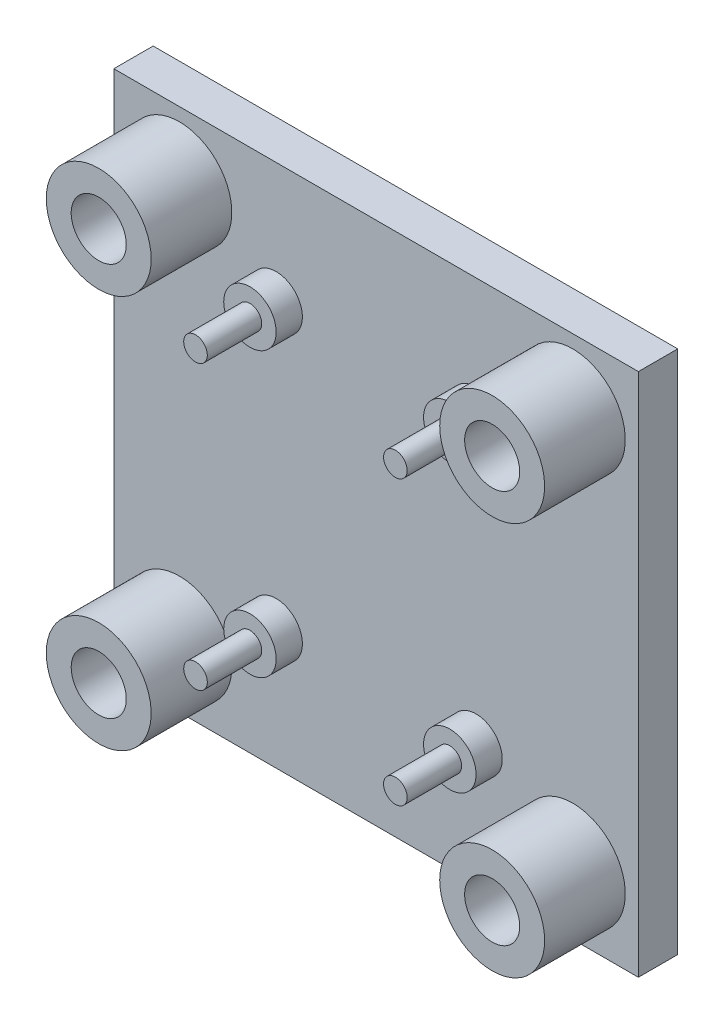
ISO-10303-21;
HEADER;
FILE_DESCRIPTION(('STEP AP214'),'2;1');
FILE_NAME('part.step','',(''),(''),'','','');
FILE_SCHEMA(('AUTOMOTIVE_DESIGN { 1 0 10303 214 1 1 1 1 }'));
ENDSEC;
DATA;
#1=APPLICATION_CONTEXT('core data for automotive mechanical design processes');
#2=APPLICATION_PROTOCOL_DEFINITION('international standard','automotive_design',2000,#1);
#3=PRODUCT_CONTEXT('',#1,'mechanical');
#4=PRODUCT('Part','Part','',(#3));
#5=PRODUCT_RELATED_PRODUCT_CATEGORY('part','',(#4));
#6=PRODUCT_DEFINITION_FORMATION('','',#4);
#7=PRODUCT_DEFINITION_CONTEXT('part definition',#1,'design');
#8=PRODUCT_DEFINITION('design','',#6,#7);
#9=PRODUCT_DEFINITION_SHAPE('','',#8);
#10=(LENGTH_UNIT() NAMED_UNIT(*) SI_UNIT(.MILLI.,.METRE.));
#11=(NAMED_UNIT(*) PLANE_ANGLE_UNIT() SI_UNIT($,.RADIAN.));
#12=(NAMED_UNIT(*) SI_UNIT($,.STERADIAN.) SOLID_ANGLE_UNIT());
#13=UNCERTAINTY_MEASURE_WITH_UNIT(LENGTH_MEASURE(1.E-05),#10,'distance_accuracy_value','');
#14=(GEOMETRIC_REPRESENTATION_CONTEXT(3) GLOBAL_UNCERTAINTY_ASSIGNED_CONTEXT((#13)) GLOBAL_UNIT_ASSIGNED_CONTEXT((#10,
#11,#12)) REPRESENTATION_CONTEXT('',''));
#15=CARTESIAN_POINT('',(0.,0.,0.));
#16=DIRECTION('',(0.,0.,1.));
#17=DIRECTION('',(1.,0.,0.));
#18=AXIS2_PLACEMENT_3D('',#15,#16,#17);
#19=CARTESIAN_POINT('',(20.,-20.,3.));
#20=DIRECTION('',(-1.,0.,0.));
#21=DIRECTION('',(0.,0.,1.));
#22=AXIS2_PLACEMENT_3D('',#19,#20,#21);
#23=PLANE('',#22);
#24=DIRECTION('',(0.,1.,0.));
#25=VECTOR('',#24,1.);
#26=CARTESIAN_POINT('',(20.,-20.,0.));
#27=LINE('',#26,#25);
#28=CARTESIAN_POINT('',(20.,-20.,0.));
#29=VERTEX_POINT('',#28);
#30=CARTESIAN_POINT('',(20.,20.,0.));
#31=VERTEX_POINT('',#30);
#32=EDGE_CURVE('E104',#29,#31,#27,.T.);
#33=ORIENTED_EDGE('',*,*,#32,.T.);
#34=DIRECTION('',(0.,0.,-1.));
#35=VECTOR('',#34,1.);
#36=CARTESIAN_POINT('',(20.,20.,3.));
#37=LINE('',#36,#35);
#38=CARTESIAN_POINT('',(20.,20.,3.));
#39=VERTEX_POINT('',#38);
#40=EDGE_CURVE('E95',#39,#31,#37,.T.);
#41=ORIENTED_EDGE('',*,*,#40,.F.);
#42=DIRECTION('',(0.,1.,0.));
#43=VECTOR('',#42,1.);
#44=CARTESIAN_POINT('',(20.,-20.,3.));
#45=LINE('',#44,#43);
#46=CARTESIAN_POINT('',(20.,-20.,3.));
#47=VERTEX_POINT('',#46);
#48=EDGE_CURVE('E89',#47,#39,#45,.T.);
#49=ORIENTED_EDGE('',*,*,#48,.F.);
#50=DIRECTION('',(0.,0.,-1.));
#51=VECTOR('',#50,1.);
#52=CARTESIAN_POINT('',(20.,-20.,3.));
#53=LINE('',#52,#51);
#54=EDGE_CURVE('E100',#47,#29,#53,.T.);
#55=ORIENTED_EDGE('',*,*,#54,.T.);
#56=EDGE_LOOP('',(#33,#41,#49,#55));
#57=FACE_BOUND('',#56,.T.);
#58=ADVANCED_FACE('F37',(#57),#23,.F.);
#59=CARTESIAN_POINT('',(-20.,20.,3.));
#60=DIRECTION('',(0.,-1.,0.));
#61=DIRECTION('',(0.,0.,-1.));
#62=AXIS2_PLACEMENT_3D('',#59,#60,#61);
#63=PLANE('',#62);
#64=DIRECTION('',(-1.,0.,0.));
#65=VECTOR('',#64,1.);
#66=CARTESIAN_POINT('',(-20.,20.,0.));
#67=LINE('',#66,#65);
#68=CARTESIAN_POINT('',(-20.,20.,0.));
#69=VERTEX_POINT('',#68);
#70=EDGE_CURVE('E94',#31,#69,#67,.T.);
#71=ORIENTED_EDGE('',*,*,#70,.T.);
#72=DIRECTION('',(0.,0.,-1.));
#73=VECTOR('',#72,1.);
#74=CARTESIAN_POINT('',(-20.,20.,3.));
#75=LINE('',#74,#73);
#76=CARTESIAN_POINT('',(-20.,20.,3.));
#77=VERTEX_POINT('',#76);
#78=EDGE_CURVE('E92',#77,#69,#75,.T.);
#79=ORIENTED_EDGE('',*,*,#78,.F.);
#80=DIRECTION('',(-1.,0.,0.));
#81=VECTOR('',#80,1.);
#82=CARTESIAN_POINT('',(-20.,20.,3.));
#83=LINE('',#82,#81);
#84=EDGE_CURVE('E84',#39,#77,#83,.T.);
#85=ORIENTED_EDGE('',*,*,#84,.F.);
#86=ORIENTED_EDGE('',*,*,#40,.T.);
#87=EDGE_LOOP('',(#71,#79,#85,#86));
#88=FACE_BOUND('',#87,.T.);
#89=ADVANCED_FACE('F93',(#88),#63,.F.);
#90=CARTESIAN_POINT('',(-20.,-20.,3.));
#91=DIRECTION('',(1.,0.,0.));
#92=DIRECTION('',(0.,0.,-1.));
#93=AXIS2_PLACEMENT_3D('',#90,#91,#92);
#94=PLANE('',#93);
#95=DIRECTION('',(0.,-1.,0.));
#96=VECTOR('',#95,1.);
#97=CARTESIAN_POINT('',(-20.,-20.,0.));
#98=LINE('',#97,#96);
#99=CARTESIAN_POINT('',(-20.,-20.,0.));
#100=VERTEX_POINT('',#99);
#101=EDGE_CURVE('E70',#69,#100,#98,.T.);
#102=ORIENTED_EDGE('',*,*,#101,.T.);
#103=DIRECTION('',(0.,0.,-1.));
#104=VECTOR('',#103,1.);
#105=CARTESIAN_POINT('',(-20.,-20.,3.));
#106=LINE('',#105,#104);
#107=CARTESIAN_POINT('',(-20.,-20.,3.));
#108=VERTEX_POINT('',#107);
#109=EDGE_CURVE('E96',#108,#100,#106,.T.);
#110=ORIENTED_EDGE('',*,*,#109,.F.);
#111=DIRECTION('',(0.,-1.,0.));
#112=VECTOR('',#111,1.);
#113=CARTESIAN_POINT('',(-20.,-20.,3.));
#114=LINE('',#113,#112);
#115=EDGE_CURVE('E87',#77,#108,#114,.T.);
#116=ORIENTED_EDGE('',*,*,#115,.F.);
#117=ORIENTED_EDGE('',*,*,#78,.T.);
#118=EDGE_LOOP('',(#102,#110,#116,#117));
#119=FACE_BOUND('',#118,.T.);
#120=ADVANCED_FACE('F98',(#119),#94,.F.);
#121=CARTESIAN_POINT('',(-20.,-20.,3.));
#122=DIRECTION('',(0.,1.,0.));
#123=DIRECTION('',(0.,0.,1.));
#124=AXIS2_PLACEMENT_3D('',#121,#122,#123);
#125=PLANE('',#124);
#126=DIRECTION('',(1.,0.,0.));
#127=VECTOR('',#126,1.);
#128=CARTESIAN_POINT('',(-20.,-20.,0.));
#129=LINE('',#128,#127);
#130=EDGE_CURVE('E76',#100,#29,#129,.T.);
#131=ORIENTED_EDGE('',*,*,#130,.T.);
#132=ORIENTED_EDGE('',*,*,#54,.F.);
#133=DIRECTION('',(1.,0.,0.));
#134=VECTOR('',#133,1.);
#135=CARTESIAN_POINT('',(-20.,-20.,3.));
#136=LINE('',#135,#134);
#137=EDGE_CURVE('E53',#108,#47,#136,.T.);
#138=ORIENTED_EDGE('',*,*,#137,.F.);
#139=ORIENTED_EDGE('',*,*,#109,.T.);
#140=EDGE_LOOP('',(#131,#132,#138,#139));
#141=FACE_BOUND('',#140,.T.);
#142=ADVANCED_FACE('F141',(#141),#125,.F.);
#143=CARTESIAN_POINT('',(0.,0.,3.));
#144=DIRECTION('',(0.,0.,-1.));
#145=DIRECTION('',(-1.,0.,0.));
#146=AXIS2_PLACEMENT_3D('',#143,#144,#145);
#147=PLANE('',#146);
#148=CARTESIAN_POINT('',(15.,15.,3.));
#149=DIRECTION('',(0.,0.,-1.));
#150=DIRECTION('',(-1.,0.,0.));
#151=AXIS2_PLACEMENT_3D('',#148,#149,#150);
#152=CIRCLE('',#151,4.);
#153=CARTESIAN_POINT('',(11.,15.,3.));
#154=VERTEX_POINT('',#153);
#155=EDGE_CURVE('E11',#154,#154,#152,.F.);
#156=ORIENTED_EDGE('',*,*,#155,.F.);
#157=EDGE_LOOP('',(#156));
#158=FACE_BOUND('',#157,.T.);
#159=CARTESIAN_POINT('',(15.,-15.,3.));
#160=DIRECTION('',(0.,0.,-1.));
#161=DIRECTION('',(-1.,0.,0.));
#162=AXIS2_PLACEMENT_3D('',#159,#160,#161);
#163=CIRCLE('',#162,4.);
#164=CARTESIAN_POINT('',(11.,-15.,3.));
#165=VERTEX_POINT('',#164);
#166=EDGE_CURVE('E45',#165,#165,#163,.F.);
#167=ORIENTED_EDGE('',*,*,#166,.F.);
#168=EDGE_LOOP('',(#167));
#169=FACE_BOUND('',#168,.T.);
#170=CARTESIAN_POINT('',(-15.,-15.,3.));
#171=DIRECTION('',(0.,0.,-1.));
#172=DIRECTION('',(-1.,0.,0.));
#173=AXIS2_PLACEMENT_3D('',#170,#171,#172);
#174=CIRCLE('',#173,4.);
#175=CARTESIAN_POINT('',(-19.,-15.,3.));
#176=VERTEX_POINT('',#175);
#177=EDGE_CURVE('E130',#176,#176,#174,.F.);
#178=ORIENTED_EDGE('',*,*,#177,.F.);
#179=EDGE_LOOP('',(#178));
#180=FACE_BOUND('',#179,.T.);
#181=CARTESIAN_POINT('',(-15.,15.,3.));
#182=DIRECTION('',(0.,0.,-1.));
#183=DIRECTION('',(-1.,0.,0.));
#184=AXIS2_PLACEMENT_3D('',#181,#182,#183);
#185=CIRCLE('',#184,4.);
#186=CARTESIAN_POINT('',(-19.,15.,3.));
#187=VERTEX_POINT('',#186);
#188=EDGE_CURVE('E127',#187,#187,#185,.F.);
#189=ORIENTED_EDGE('',*,*,#188,.F.);
#190=EDGE_LOOP('',(#189));
#191=FACE_BOUND('',#190,.T.);
#192=CARTESIAN_POINT('',(7.62,-10.795,3.));
#193=DIRECTION('',(0.,0.,-1.));
#194=DIRECTION('',(-1.,0.,0.));
#195=AXIS2_PLACEMENT_3D('',#192,#193,#194);
#196=CIRCLE('',#195,2.);
#197=CARTESIAN_POINT('',(5.62,-10.795,3.));
#198=VERTEX_POINT('',#197);
#199=EDGE_CURVE('E123',#198,#198,#196,.F.);
#200=ORIENTED_EDGE('',*,*,#199,.F.);
#201=EDGE_LOOP('',(#200));
#202=FACE_BOUND('',#201,.T.);
#203=CARTESIAN_POINT('',(7.62,10.795,3.));
#204=DIRECTION('',(0.,0.,-1.));
#205=DIRECTION('',(-1.,0.,0.));
#206=AXIS2_PLACEMENT_3D('',#203,#204,#205);
#207=CIRCLE('',#206,2.);
#208=CARTESIAN_POINT('',(5.62,10.795,3.));
#209=VERTEX_POINT('',#208);
#210=EDGE_CURVE('E120',#209,#209,#207,.F.);
#211=ORIENTED_EDGE('',*,*,#210,.F.);
#212=EDGE_LOOP('',(#211));
#213=FACE_BOUND('',#212,.T.);
#214=CARTESIAN_POINT('',(-7.62,-10.795,3.));
#215=DIRECTION('',(0.,0.,-1.));
#216=DIRECTION('',(-1.,0.,0.));
#217=AXIS2_PLACEMENT_3D('',#214,#215,#216);
#218=CIRCLE('',#217,2.);
#219=CARTESIAN_POINT('',(-9.62,-10.795,3.));
#220=VERTEX_POINT('',#219);
#221=EDGE_CURVE('E117',#220,#220,#218,.F.);
#222=ORIENTED_EDGE('',*,*,#221,.F.);
#223=EDGE_LOOP('',(#222));
#224=FACE_BOUND('',#223,.T.);
#225=CARTESIAN_POINT('',(-7.62,10.795,3.));
#226=DIRECTION('',(0.,0.,-1.));
#227=DIRECTION('',(-1.,0.,0.));
#228=AXIS2_PLACEMENT_3D('',#225,#226,#227);
#229=CIRCLE('',#228,2.);
#230=CARTESIAN_POINT('',(-9.62,10.795,3.));
#231=VERTEX_POINT('',#230);
#232=EDGE_CURVE('E114',#231,#231,#229,.F.);
#233=ORIENTED_EDGE('',*,*,#232,.F.);
#234=EDGE_LOOP('',(#233));
#235=FACE_BOUND('',#234,.T.);
#236=ORIENTED_EDGE('',*,*,#48,.T.);
#237=ORIENTED_EDGE('',*,*,#84,.T.);
#238=ORIENTED_EDGE('',*,*,#115,.T.);
#239=ORIENTED_EDGE('',*,*,#137,.T.);
#240=EDGE_LOOP('',(#236,#237,#238,#239));
#241=FACE_BOUND('',#240,.T.);
#242=ADVANCED_FACE('F85',(#158,#169,#180,#191,#202,#213,#224,#235,#241),#147,.F.);
#243=CARTESIAN_POINT('',(0.,0.,0.));
#244=DIRECTION('',(0.,0.,-1.));
#245=DIRECTION('',(-1.,0.,0.));
#246=AXIS2_PLACEMENT_3D('',#243,#244,#245);
#247=PLANE('',#246);
#248=CARTESIAN_POINT('',(15.,15.,0.));
#249=DIRECTION('',(0.,0.,1.));
#250=DIRECTION('',(-1.,0.,0.));
#251=AXIS2_PLACEMENT_3D('',#248,#249,#250);
#252=CIRCLE('',#251,2.1);
#253=CARTESIAN_POINT('',(12.9,15.,0.));
#254=VERTEX_POINT('',#253);
#255=EDGE_CURVE('E580',#254,#254,#252,.T.);
#256=ORIENTED_EDGE('',*,*,#255,.T.);
#257=EDGE_LOOP('',(#256));
#258=FACE_BOUND('',#257,.T.);
#259=CARTESIAN_POINT('',(15.,-15.,0.));
#260=DIRECTION('',(0.,0.,1.));
#261=DIRECTION('',(1.,0.,0.));
#262=AXIS2_PLACEMENT_3D('',#259,#260,#261);
#263=CIRCLE('',#262,2.1);
#264=CARTESIAN_POINT('',(17.1,-15.,0.));
#265=VERTEX_POINT('',#264);
#266=EDGE_CURVE('E586',#265,#265,#263,.T.);
#267=ORIENTED_EDGE('',*,*,#266,.T.);
#268=EDGE_LOOP('',(#267));
#269=FACE_BOUND('',#268,.T.);
#270=CARTESIAN_POINT('',(-15.,-15.,0.));
#271=DIRECTION('',(0.,0.,1.));
#272=DIRECTION('',(-1.,0.,0.));
#273=AXIS2_PLACEMENT_3D('',#270,#271,#272);
#274=CIRCLE('',#273,2.1);
#275=CARTESIAN_POINT('',(-17.1,-15.,0.));
#276=VERTEX_POINT('',#275);
#277=EDGE_CURVE('E491',#276,#276,#274,.T.);
#278=ORIENTED_EDGE('',*,*,#277,.T.);
#279=EDGE_LOOP('',(#278));
#280=FACE_BOUND('',#279,.T.);
#281=CARTESIAN_POINT('',(-15.,15.,0.));
#282=DIRECTION('',(0.,0.,1.));
#283=DIRECTION('',(1.,0.,0.));
#284=AXIS2_PLACEMENT_3D('',#281,#282,#283);
#285=CIRCLE('',#284,2.1);
#286=CARTESIAN_POINT('',(-12.9,15.,0.));
#287=VERTEX_POINT('',#286);
#288=EDGE_CURVE('E487',#287,#287,#285,.T.);
#289=ORIENTED_EDGE('',*,*,#288,.T.);
#290=EDGE_LOOP('',(#289));
#291=FACE_BOUND('',#290,.T.);
#292=ORIENTED_EDGE('',*,*,#32,.F.);
#293=ORIENTED_EDGE('',*,*,#130,.F.);
#294=ORIENTED_EDGE('',*,*,#101,.F.);
#295=ORIENTED_EDGE('',*,*,#70,.F.);
#296=EDGE_LOOP('',(#292,#293,#294,#295));
#297=FACE_BOUND('',#296,.T.);
#298=ADVANCED_FACE('F140',(#258,#269,#280,#291,#297),#247,.T.);
#299=CARTESIAN_POINT('',(-7.62,10.795,5.));
#300=DIRECTION('',(0.,0.,-1.));
#301=DIRECTION('',(-1.,0.,0.));
#302=AXIS2_PLACEMENT_3D('',#299,#300,#301);
#303=CYLINDRICAL_SURFACE('',#302,2.);
#304=CARTESIAN_POINT('',(-7.62,10.795,5.));
#305=DIRECTION('',(0.,0.,1.));
#306=DIRECTION('',(1.,0.,0.));
#307=AXIS2_PLACEMENT_3D('',#304,#305,#306);
#308=CIRCLE('',#307,2.);
#309=CARTESIAN_POINT('',(-5.62,10.795,5.));
#310=VERTEX_POINT('',#309);
#311=EDGE_CURVE('E107',#310,#310,#308,.T.);
#312=ORIENTED_EDGE('',*,*,#311,.F.);
#313=EDGE_LOOP('',(#312));
#314=FACE_BOUND('',#313,.T.);
#315=ORIENTED_EDGE('',*,*,#232,.T.);
#316=EDGE_LOOP('',(#315));
#317=FACE_BOUND('',#316,.T.);
#318=ADVANCED_FACE('F156',(#314,#317),#303,.T.);
#319=CARTESIAN_POINT('',(-7.62,10.795,5.));
#320=DIRECTION('',(0.,0.,1.));
#321=DIRECTION('',(1.,0.,0.));
#322=AXIS2_PLACEMENT_3D('',#319,#320,#321);
#323=PLANE('',#322);
#324=CARTESIAN_POINT('',(-7.62,10.795,5.));
#325=DIRECTION('',(0.,0.,1.));
#326=DIRECTION('',(1.,0.,0.));
#327=AXIS2_PLACEMENT_3D('',#324,#325,#326);
#328=CIRCLE('',#327,0.899999999999999);
#329=CARTESIAN_POINT('',(-6.72,10.795,5.));
#330=VERTEX_POINT('',#329);
#331=EDGE_CURVE('E126',#330,#330,#328,.T.);
#332=ORIENTED_EDGE('',*,*,#331,.F.);
#333=EDGE_LOOP('',(#332));
#334=FACE_BOUND('',#333,.T.);
#335=ORIENTED_EDGE('',*,*,#311,.T.);
#336=EDGE_LOOP('',(#335));
#337=FACE_BOUND('',#336,.T.);
#338=ADVANCED_FACE('F158',(#334,#337),#323,.T.);
#339=CARTESIAN_POINT('',(-7.62,-10.795,5.));
#340=DIRECTION('',(0.,0.,-1.));
#341=DIRECTION('',(-1.,0.,0.));
#342=AXIS2_PLACEMENT_3D('',#339,#340,#341);
#343=CYLINDRICAL_SURFACE('',#342,2.);
#344=CARTESIAN_POINT('',(-7.62,-10.795,5.));
#345=DIRECTION('',(0.,0.,1.));
#346=DIRECTION('',(-1.,0.,0.));
#347=AXIS2_PLACEMENT_3D('',#344,#345,#346);
#348=CIRCLE('',#347,2.);
#349=CARTESIAN_POINT('',(-9.62,-10.795,5.));
#350=VERTEX_POINT('',#349);
#351=EDGE_CURVE('E539',#350,#350,#348,.T.);
#352=ORIENTED_EDGE('',*,*,#351,.F.);
#353=EDGE_LOOP('',(#352));
#354=FACE_BOUND('',#353,.T.);
#355=ORIENTED_EDGE('',*,*,#221,.T.);
#356=EDGE_LOOP('',(#355));
#357=FACE_BOUND('',#356,.T.);
#358=ADVANCED_FACE('F165',(#354,#357),#343,.T.);
#359=CARTESIAN_POINT('',(-7.62,-10.795,5.));
#360=DIRECTION('',(0.,0.,-1.));
#361=DIRECTION('',(-1.,0.,0.));
#362=AXIS2_PLACEMENT_3D('',#359,#360,#361);
#363=PLANE('',#362);
#364=CARTESIAN_POINT('',(-7.61999999999999,-10.795,5.));
#365=DIRECTION('',(0.,0.,1.));
#366=DIRECTION('',(-1.,0.,0.));
#367=AXIS2_PLACEMENT_3D('',#364,#365,#366);
#368=CIRCLE('',#367,0.899999999999999);
#369=CARTESIAN_POINT('',(-8.51999999999998,-10.795,5.));
#370=VERTEX_POINT('',#369);
#371=EDGE_CURVE('E523',#370,#370,#368,.T.);
#372=ORIENTED_EDGE('',*,*,#371,.F.);
#373=EDGE_LOOP('',(#372));
#374=FACE_BOUND('',#373,.T.);
#375=ORIENTED_EDGE('',*,*,#351,.T.);
#376=EDGE_LOOP('',(#375));
#377=FACE_BOUND('',#376,.T.);
#378=ADVANCED_FACE('F237',(#374,#377),#363,.F.);
#379=CARTESIAN_POINT('',(7.62,10.795,5.));
#380=DIRECTION('',(0.,0.,-1.));
#381=DIRECTION('',(-1.,0.,0.));
#382=AXIS2_PLACEMENT_3D('',#379,#380,#381);
#383=CYLINDRICAL_SURFACE('',#382,2.);
#384=CARTESIAN_POINT('',(7.62,10.795,5.));
#385=DIRECTION('',(0.,0.,1.));
#386=DIRECTION('',(-1.,0.,0.));
#387=AXIS2_PLACEMENT_3D('',#384,#385,#386);
#388=CIRCLE('',#387,2.);
#389=CARTESIAN_POINT('',(5.62,10.795,5.));
#390=VERTEX_POINT('',#389);
#391=EDGE_CURVE('E536',#390,#390,#388,.T.);
#392=ORIENTED_EDGE('',*,*,#391,.F.);
#393=EDGE_LOOP('',(#392));
#394=FACE_BOUND('',#393,.T.);
#395=ORIENTED_EDGE('',*,*,#210,.T.);
#396=EDGE_LOOP('',(#395));
#397=FACE_BOUND('',#396,.T.);
#398=ADVANCED_FACE('F246',(#394,#397),#383,.T.);
#399=CARTESIAN_POINT('',(7.62,10.795,5.));
#400=DIRECTION('',(0.,0.,-1.));
#401=DIRECTION('',(-1.,0.,0.));
#402=AXIS2_PLACEMENT_3D('',#399,#400,#401);
#403=PLANE('',#402);
#404=CARTESIAN_POINT('',(7.62,10.795,5.));
#405=DIRECTION('',(0.,0.,1.));
#406=DIRECTION('',(-1.,0.,0.));
#407=AXIS2_PLACEMENT_3D('',#404,#405,#406);
#408=CIRCLE('',#407,0.900000000000001);
#409=CARTESIAN_POINT('',(6.72,10.795,5.));
#410=VERTEX_POINT('',#409);
#411=EDGE_CURVE('E131',#410,#410,#408,.T.);
#412=ORIENTED_EDGE('',*,*,#411,.F.);
#413=EDGE_LOOP('',(#412));
#414=FACE_BOUND('',#413,.T.);
#415=ORIENTED_EDGE('',*,*,#391,.T.);
#416=EDGE_LOOP('',(#415));
#417=FACE_BOUND('',#416,.T.);
#418=ADVANCED_FACE('F255',(#414,#417),#403,.F.);
#419=CARTESIAN_POINT('',(7.62,-10.795,5.));
#420=DIRECTION('',(0.,0.,-1.));
#421=DIRECTION('',(-1.,0.,0.));
#422=AXIS2_PLACEMENT_3D('',#419,#420,#421);
#423=CYLINDRICAL_SURFACE('',#422,2.);
#424=CARTESIAN_POINT('',(7.62,-10.795,5.));
#425=DIRECTION('',(0.,0.,1.));
#426=DIRECTION('',(1.,0.,0.));
#427=AXIS2_PLACEMENT_3D('',#424,#425,#426);
#428=CIRCLE('',#427,2.);
#429=CARTESIAN_POINT('',(9.61999999999999,-10.795,5.));
#430=VERTEX_POINT('',#429);
#431=EDGE_CURVE('E531',#430,#430,#428,.T.);
#432=ORIENTED_EDGE('',*,*,#431,.F.);
#433=EDGE_LOOP('',(#432));
#434=FACE_BOUND('',#433,.T.);
#435=ORIENTED_EDGE('',*,*,#199,.T.);
#436=EDGE_LOOP('',(#435));
#437=FACE_BOUND('',#436,.T.);
#438=ADVANCED_FACE('F263',(#434,#437),#423,.T.);
#439=CARTESIAN_POINT('',(7.62,-10.795,5.));
#440=DIRECTION('',(0.,0.,1.));
#441=DIRECTION('',(1.,0.,0.));
#442=AXIS2_PLACEMENT_3D('',#439,#440,#441);
#443=PLANE('',#442);
#444=CARTESIAN_POINT('',(7.61999999999999,-10.795,5.));
#445=DIRECTION('',(0.,0.,1.));
#446=DIRECTION('',(1.,0.,0.));
#447=AXIS2_PLACEMENT_3D('',#444,#445,#446);
#448=CIRCLE('',#447,0.900000000000001);
#449=CARTESIAN_POINT('',(8.51999999999999,-10.795,5.));
#450=VERTEX_POINT('',#449);
#451=EDGE_CURVE('E517',#450,#450,#448,.T.);
#452=ORIENTED_EDGE('',*,*,#451,.F.);
#453=EDGE_LOOP('',(#452));
#454=FACE_BOUND('',#453,.T.);
#455=ORIENTED_EDGE('',*,*,#431,.T.);
#456=EDGE_LOOP('',(#455));
#457=FACE_BOUND('',#456,.T.);
#458=ADVANCED_FACE('F272',(#454,#457),#443,.T.);
#459=CARTESIAN_POINT('',(-7.62,10.795,9.15));
#460=DIRECTION('',(0.,0.,-1.));
#461=DIRECTION('',(-1.,0.,0.));
#462=AXIS2_PLACEMENT_3D('',#459,#460,#461);
#463=CYLINDRICAL_SURFACE('',#462,0.899999999999999);
#464=CARTESIAN_POINT('',(-7.62,10.795,9.15));
#465=DIRECTION('',(0.,0.,1.));
#466=DIRECTION('',(1.,0.,0.));
#467=AXIS2_PLACEMENT_3D('',#464,#465,#466);
#468=CIRCLE('',#467,0.899999999999999);
#469=CARTESIAN_POINT('',(-6.72,10.795,9.15));
#470=VERTEX_POINT('',#469);
#471=EDGE_CURVE('E526',#470,#470,#468,.T.);
#472=ORIENTED_EDGE('',*,*,#471,.F.);
#473=EDGE_LOOP('',(#472));
#474=FACE_BOUND('',#473,.T.);
#475=ORIENTED_EDGE('',*,*,#331,.T.);
#476=EDGE_LOOP('',(#475));
#477=FACE_BOUND('',#476,.T.);
#478=ADVANCED_FACE('F280',(#474,#477),#463,.T.);
#479=CARTESIAN_POINT('',(-7.62,10.795,9.15));
#480=DIRECTION('',(0.,0.,1.));
#481=DIRECTION('',(1.,0.,0.));
#482=AXIS2_PLACEMENT_3D('',#479,#480,#481);
#483=PLANE('',#482);
#484=ORIENTED_EDGE('',*,*,#471,.T.);
#485=EDGE_LOOP('',(#484));
#486=FACE_BOUND('',#485,.T.);
#487=ADVANCED_FACE('F289',(#486),#483,.T.);
#488=CARTESIAN_POINT('',(-7.61999999999999,-10.795,9.15));
#489=DIRECTION('',(0.,0.,-1.));
#490=DIRECTION('',(-1.,0.,0.));
#491=AXIS2_PLACEMENT_3D('',#488,#489,#490);
#492=CYLINDRICAL_SURFACE('',#491,0.899999999999999);
#493=CARTESIAN_POINT('',(-7.61999999999999,-10.795,9.15));
#494=DIRECTION('',(0.,0.,1.));
#495=DIRECTION('',(-1.,0.,0.));
#496=AXIS2_PLACEMENT_3D('',#493,#494,#495);
#497=CIRCLE('',#496,0.899999999999999);
#498=CARTESIAN_POINT('',(-8.51999999999998,-10.795,9.15));
#499=VERTEX_POINT('',#498);
#500=EDGE_CURVE('E520',#499,#499,#497,.T.);
#501=ORIENTED_EDGE('',*,*,#500,.F.);
#502=EDGE_LOOP('',(#501));
#503=FACE_BOUND('',#502,.T.);
#504=ORIENTED_EDGE('',*,*,#371,.T.);
#505=EDGE_LOOP('',(#504));
#506=FACE_BOUND('',#505,.T.);
#507=ADVANCED_FACE('F298',(#503,#506),#492,.T.);
#508=CARTESIAN_POINT('',(-7.61999999999999,-10.795,9.15));
#509=DIRECTION('',(0.,0.,-1.));
#510=DIRECTION('',(-1.,0.,0.));
#511=AXIS2_PLACEMENT_3D('',#508,#509,#510);
#512=PLANE('',#511);
#513=ORIENTED_EDGE('',*,*,#500,.T.);
#514=EDGE_LOOP('',(#513));
#515=FACE_BOUND('',#514,.T.);
#516=ADVANCED_FACE('F307',(#515),#512,.F.);
#517=CARTESIAN_POINT('',(7.61999999999999,-10.795,9.15));
#518=DIRECTION('',(0.,0.,-1.));
#519=DIRECTION('',(-1.,0.,0.));
#520=AXIS2_PLACEMENT_3D('',#517,#518,#519);
#521=CYLINDRICAL_SURFACE('',#520,0.900000000000001);
#522=CARTESIAN_POINT('',(7.61999999999999,-10.795,9.15));
#523=DIRECTION('',(0.,0.,1.));
#524=DIRECTION('',(1.,0.,0.));
#525=AXIS2_PLACEMENT_3D('',#522,#523,#524);
#526=CIRCLE('',#525,0.900000000000001);
#527=CARTESIAN_POINT('',(8.51999999999999,-10.795,9.15));
#528=VERTEX_POINT('',#527);
#529=EDGE_CURVE('E514',#528,#528,#526,.T.);
#530=ORIENTED_EDGE('',*,*,#529,.F.);
#531=EDGE_LOOP('',(#530));
#532=FACE_BOUND('',#531,.T.);
#533=ORIENTED_EDGE('',*,*,#451,.T.);
#534=EDGE_LOOP('',(#533));
#535=FACE_BOUND('',#534,.T.);
#536=ADVANCED_FACE('F316',(#532,#535),#521,.T.);
#537=CARTESIAN_POINT('',(7.61999999999999,-10.795,9.15));
#538=DIRECTION('',(0.,0.,1.));
#539=DIRECTION('',(1.,0.,0.));
#540=AXIS2_PLACEMENT_3D('',#537,#538,#539);
#541=PLANE('',#540);
#542=ORIENTED_EDGE('',*,*,#529,.T.);
#543=EDGE_LOOP('',(#542));
#544=FACE_BOUND('',#543,.T.);
#545=ADVANCED_FACE('F325',(#544),#541,.T.);
#546=CARTESIAN_POINT('',(7.62,10.795,9.15));
#547=DIRECTION('',(0.,0.,-1.));
#548=DIRECTION('',(-1.,0.,0.));
#549=AXIS2_PLACEMENT_3D('',#546,#547,#548);
#550=CYLINDRICAL_SURFACE('',#549,0.900000000000001);
#551=CARTESIAN_POINT('',(7.62,10.795,9.15));
#552=DIRECTION('',(0.,0.,1.));
#553=DIRECTION('',(-1.,0.,0.));
#554=AXIS2_PLACEMENT_3D('',#551,#552,#553);
#555=CIRCLE('',#554,0.900000000000001);
#556=CARTESIAN_POINT('',(6.72,10.795,9.15));
#557=VERTEX_POINT('',#556);
#558=EDGE_CURVE('E511',#557,#557,#555,.T.);
#559=ORIENTED_EDGE('',*,*,#558,.F.);
#560=EDGE_LOOP('',(#559));
#561=FACE_BOUND('',#560,.T.);
#562=ORIENTED_EDGE('',*,*,#411,.T.);
#563=EDGE_LOOP('',(#562));
#564=FACE_BOUND('',#563,.T.);
#565=ADVANCED_FACE('F334',(#561,#564),#550,.T.);
#566=CARTESIAN_POINT('',(7.62,10.795,9.15));
#567=DIRECTION('',(0.,0.,-1.));
#568=DIRECTION('',(-1.,0.,0.));
#569=AXIS2_PLACEMENT_3D('',#566,#567,#568);
#570=PLANE('',#569);
#571=ORIENTED_EDGE('',*,*,#558,.T.);
#572=EDGE_LOOP('',(#571));
#573=FACE_BOUND('',#572,.T.);
#574=ADVANCED_FACE('F343',(#573),#570,.F.);
#575=CARTESIAN_POINT('',(-15.,15.,9.15));
#576=DIRECTION('',(0.,0.,-1.));
#577=DIRECTION('',(-1.,0.,0.));
#578=AXIS2_PLACEMENT_3D('',#575,#576,#577);
#579=CYLINDRICAL_SURFACE('',#578,4.);
#580=CARTESIAN_POINT('',(-15.,15.,9.15));
#581=DIRECTION('',(0.,0.,1.));
#582=DIRECTION('',(1.,0.,0.));
#583=AXIS2_PLACEMENT_3D('',#580,#581,#582);
#584=CIRCLE('',#583,4.);
#585=CARTESIAN_POINT('',(-11.,15.,9.15));
#586=VERTEX_POINT('',#585);
#587=EDGE_CURVE('E508',#586,#586,#584,.T.);
#588=ORIENTED_EDGE('',*,*,#587,.F.);
#589=EDGE_LOOP('',(#588));
#590=FACE_BOUND('',#589,.T.);
#591=ORIENTED_EDGE('',*,*,#188,.T.);
#592=EDGE_LOOP('',(#591));
#593=FACE_BOUND('',#592,.T.);
#594=ADVANCED_FACE('F351',(#590,#593),#579,.T.);
#595=CARTESIAN_POINT('',(-15.,15.,9.15));
#596=DIRECTION('',(0.,0.,1.));
#597=DIRECTION('',(1.,0.,0.));
#598=AXIS2_PLACEMENT_3D('',#595,#596,#597);
#599=PLANE('',#598);
#600=CARTESIAN_POINT('',(-15.,15.,9.15));
#601=DIRECTION('',(0.,0.,1.));
#602=DIRECTION('',(1.,0.,0.));
#603=AXIS2_PLACEMENT_3D('',#600,#601,#602);
#604=CIRCLE('',#603,2.1);
#605=CARTESIAN_POINT('',(-12.9,15.,9.15));
#606=VERTEX_POINT('',#605);
#607=EDGE_CURVE('E490',#606,#606,#604,.T.);
#608=ORIENTED_EDGE('',*,*,#607,.F.);
#609=EDGE_LOOP('',(#608));
#610=FACE_BOUND('',#609,.T.);
#611=ORIENTED_EDGE('',*,*,#587,.T.);
#612=EDGE_LOOP('',(#611));
#613=FACE_BOUND('',#612,.T.);
#614=ADVANCED_FACE('F359',(#610,#613),#599,.T.);
#615=CARTESIAN_POINT('',(-15.,-15.,9.15));
#616=DIRECTION('',(0.,0.,-1.));
#617=DIRECTION('',(-1.,0.,0.));
#618=AXIS2_PLACEMENT_3D('',#615,#616,#617);
#619=CYLINDRICAL_SURFACE('',#618,4.);
#620=CARTESIAN_POINT('',(-15.,-15.,9.15));
#621=DIRECTION('',(0.,0.,1.));
#622=DIRECTION('',(-1.,0.,0.));
#623=AXIS2_PLACEMENT_3D('',#620,#621,#622);
#624=CIRCLE('',#623,4.);
#625=CARTESIAN_POINT('',(-19.,-15.,9.15));
#626=VERTEX_POINT('',#625);
#627=EDGE_CURVE('E505',#626,#626,#624,.T.);
#628=ORIENTED_EDGE('',*,*,#627,.F.);
#629=EDGE_LOOP('',(#628));
#630=FACE_BOUND('',#629,.T.);
#631=ORIENTED_EDGE('',*,*,#177,.T.);
#632=EDGE_LOOP('',(#631));
#633=FACE_BOUND('',#632,.T.);
#634=ADVANCED_FACE('F368',(#630,#633),#619,.T.);
#635=CARTESIAN_POINT('',(-15.,-15.,9.15));
#636=DIRECTION('',(0.,0.,-1.));
#637=DIRECTION('',(-1.,0.,0.));
#638=AXIS2_PLACEMENT_3D('',#635,#636,#637);
#639=PLANE('',#638);
#640=CARTESIAN_POINT('',(-15.,-15.,9.15));
#641=DIRECTION('',(0.,0.,1.));
#642=DIRECTION('',(-1.,0.,0.));
#643=AXIS2_PLACEMENT_3D('',#640,#641,#642);
#644=CIRCLE('',#643,2.1);
#645=CARTESIAN_POINT('',(-17.1,-15.,9.15));
#646=VERTEX_POINT('',#645);
#647=EDGE_CURVE('E496',#646,#646,#644,.T.);
#648=ORIENTED_EDGE('',*,*,#647,.F.);
#649=EDGE_LOOP('',(#648));
#650=FACE_BOUND('',#649,.T.);
#651=ORIENTED_EDGE('',*,*,#627,.T.);
#652=EDGE_LOOP('',(#651));
#653=FACE_BOUND('',#652,.T.);
#654=ADVANCED_FACE('F377',(#650,#653),#639,.F.);
#655=CARTESIAN_POINT('',(15.,-15.,9.15));
#656=DIRECTION('',(0.,0.,-1.));
#657=DIRECTION('',(-1.,0.,0.));
#658=AXIS2_PLACEMENT_3D('',#655,#656,#657);
#659=CYLINDRICAL_SURFACE('',#658,4.);
#660=CARTESIAN_POINT('',(15.,-15.,9.15));
#661=DIRECTION('',(0.,0.,1.));
#662=DIRECTION('',(1.,0.,0.));
#663=AXIS2_PLACEMENT_3D('',#660,#661,#662);
#664=CIRCLE('',#663,4.);
#665=CARTESIAN_POINT('',(19.,-15.,9.15));
#666=VERTEX_POINT('',#665);
#667=EDGE_CURVE('E502',#666,#666,#664,.T.);
#668=ORIENTED_EDGE('',*,*,#667,.F.);
#669=EDGE_LOOP('',(#668));
#670=FACE_BOUND('',#669,.T.);
#671=ORIENTED_EDGE('',*,*,#166,.T.);
#672=EDGE_LOOP('',(#671));
#673=FACE_BOUND('',#672,.T.);
#674=ADVANCED_FACE('F136',(#670,#673),#659,.T.);
#675=CARTESIAN_POINT('',(15.,-15.,9.15));
#676=DIRECTION('',(0.,0.,1.));
#677=DIRECTION('',(1.,0.,0.));
#678=AXIS2_PLACEMENT_3D('',#675,#676,#677);
#679=PLANE('',#678);
#680=CARTESIAN_POINT('',(15.,-15.,9.15));
#681=DIRECTION('',(0.,0.,1.));
#682=DIRECTION('',(1.,0.,0.));
#683=AXIS2_PLACEMENT_3D('',#680,#681,#682);
#684=CIRCLE('',#683,2.1);
#685=CARTESIAN_POINT('',(17.1,-15.,9.15));
#686=VERTEX_POINT('',#685);
#687=EDGE_CURVE('E583',#686,#686,#684,.T.);
#688=ORIENTED_EDGE('',*,*,#687,.F.);
#689=EDGE_LOOP('',(#688));
#690=FACE_BOUND('',#689,.T.);
#691=ORIENTED_EDGE('',*,*,#667,.T.);
#692=EDGE_LOOP('',(#691));
#693=FACE_BOUND('',#692,.T.);
#694=ADVANCED_FACE('F394',(#690,#693),#679,.T.);
#695=CARTESIAN_POINT('',(15.,15.,9.15));
#696=DIRECTION('',(0.,0.,-1.));
#697=DIRECTION('',(-1.,0.,0.));
#698=AXIS2_PLACEMENT_3D('',#695,#696,#697);
#699=CYLINDRICAL_SURFACE('',#698,4.);
#700=CARTESIAN_POINT('',(15.,15.,9.15));
#701=DIRECTION('',(0.,0.,1.));
#702=DIRECTION('',(-1.,0.,0.));
#703=AXIS2_PLACEMENT_3D('',#700,#701,#702);
#704=CIRCLE('',#703,4.);
#705=CARTESIAN_POINT('',(11.,15.,9.15));
#706=VERTEX_POINT('',#705);
#707=EDGE_CURVE('E493',#706,#706,#704,.T.);
#708=ORIENTED_EDGE('',*,*,#707,.F.);
#709=EDGE_LOOP('',(#708));
#710=FACE_BOUND('',#709,.T.);
#711=ORIENTED_EDGE('',*,*,#155,.T.);
#712=EDGE_LOOP('',(#711));
#713=FACE_BOUND('',#712,.T.);
#714=ADVANCED_FACE('F402',(#710,#713),#699,.T.);
#715=CARTESIAN_POINT('',(15.,15.,9.15));
#716=DIRECTION('',(0.,0.,-1.));
#717=DIRECTION('',(-1.,0.,0.));
#718=AXIS2_PLACEMENT_3D('',#715,#716,#717);
#719=PLANE('',#718);
#720=CARTESIAN_POINT('',(15.,15.,9.15));
#721=DIRECTION('',(0.,0.,1.));
#722=DIRECTION('',(-1.,0.,0.));
#723=AXIS2_PLACEMENT_3D('',#720,#721,#722);
#724=CIRCLE('',#723,2.1);
#725=CARTESIAN_POINT('',(12.9,15.,9.15));
#726=VERTEX_POINT('',#725);
#727=EDGE_CURVE('E577',#726,#726,#724,.T.);
#728=ORIENTED_EDGE('',*,*,#727,.F.);
#729=EDGE_LOOP('',(#728));
#730=FACE_BOUND('',#729,.T.);
#731=ORIENTED_EDGE('',*,*,#707,.T.);
#732=EDGE_LOOP('',(#731));
#733=FACE_BOUND('',#732,.T.);
#734=ADVANCED_FACE('F411',(#730,#733),#719,.F.);
#735=CARTESIAN_POINT('',(15.,15.,0.));
#736=DIRECTION('',(0.,0.,1.));
#737=DIRECTION('',(1.,0.,0.));
#738=AXIS2_PLACEMENT_3D('',#735,#736,#737);
#739=CYLINDRICAL_SURFACE('',#738,2.1);
#740=ORIENTED_EDGE('',*,*,#255,.F.);
#741=EDGE_LOOP('',(#740));
#742=FACE_BOUND('',#741,.T.);
#743=ORIENTED_EDGE('',*,*,#727,.T.);
#744=EDGE_LOOP('',(#743));
#745=FACE_BOUND('',#744,.T.);
#746=ADVANCED_FACE('F419',(#742,#745),#739,.F.);
#747=CARTESIAN_POINT('',(15.,-15.,0.));
#748=DIRECTION('',(0.,0.,1.));
#749=DIRECTION('',(1.,0.,0.));
#750=AXIS2_PLACEMENT_3D('',#747,#748,#749);
#751=CYLINDRICAL_SURFACE('',#750,2.1);
#752=ORIENTED_EDGE('',*,*,#266,.F.);
#753=EDGE_LOOP('',(#752));
#754=FACE_BOUND('',#753,.T.);
#755=ORIENTED_EDGE('',*,*,#687,.T.);
#756=EDGE_LOOP('',(#755));
#757=FACE_BOUND('',#756,.T.);
#758=ADVANCED_FACE('F428',(#754,#757),#751,.F.);
#759=CARTESIAN_POINT('',(-15.,-15.,0.));
#760=DIRECTION('',(0.,0.,1.));
#761=DIRECTION('',(1.,0.,0.));
#762=AXIS2_PLACEMENT_3D('',#759,#760,#761);
#763=CYLINDRICAL_SURFACE('',#762,2.1);
#764=ORIENTED_EDGE('',*,*,#277,.F.);
#765=EDGE_LOOP('',(#764));
#766=FACE_BOUND('',#765,.T.);
#767=ORIENTED_EDGE('',*,*,#647,.T.);
#768=EDGE_LOOP('',(#767));
#769=FACE_BOUND('',#768,.T.);
#770=ADVANCED_FACE('F437',(#766,#769),#763,.F.);
#771=CARTESIAN_POINT('',(-15.,15.,0.));
#772=DIRECTION('',(0.,0.,1.));
#773=DIRECTION('',(1.,0.,0.));
#774=AXIS2_PLACEMENT_3D('',#771,#772,#773);
#775=CYLINDRICAL_SURFACE('',#774,2.1);
#776=ORIENTED_EDGE('',*,*,#288,.F.);
#777=EDGE_LOOP('',(#776));
#778=FACE_BOUND('',#777,.T.);
#779=ORIENTED_EDGE('',*,*,#607,.T.);
#780=EDGE_LOOP('',(#779));
#781=FACE_BOUND('',#780,.T.);
#782=ADVANCED_FACE('F446',(#778,#781),#775,.F.);
#783=CLOSED_SHELL('',(#58,#89,#120,#142,#242,#298,#318,#338,#358,#378,#398,#418,#438,#458,#478,
#487,#507,#516,#536,#545,#565,#574,#594,#614,#634,#654,#674,#694,#714,#734,#746,#758,#770,#782));
#784=MANIFOLD_SOLID_BREP('B2',#783);
#785=ADVANCED_BREP_SHAPE_REPRESENTATION('',(#18,#784),#14);
#786=SHAPE_DEFINITION_REPRESENTATION(#9,#785);
ENDSEC;
END-ISO-10303-21;
